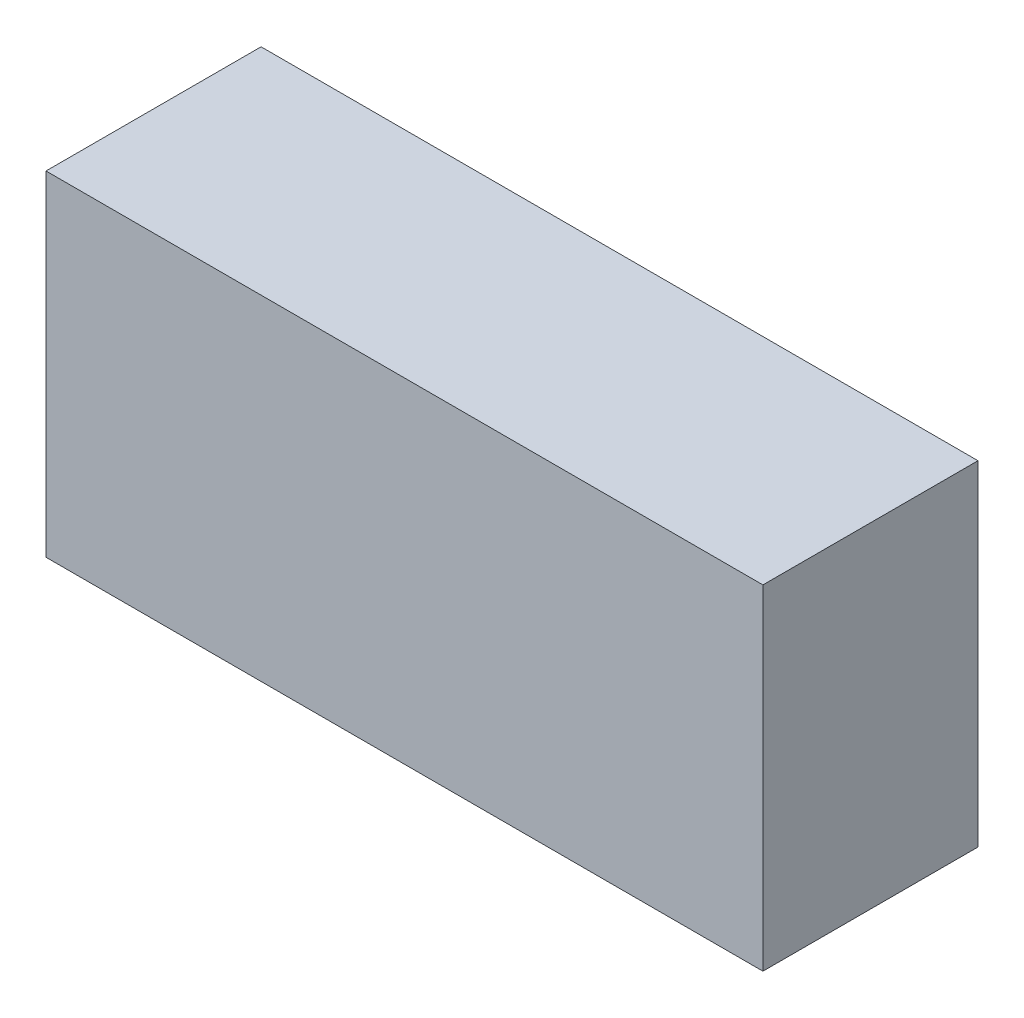
ISO-10303-21;
HEADER;
FILE_DESCRIPTION(('STEP AP214'),'2;1');
FILE_NAME('part.step','',(''),(''),'','','');
FILE_SCHEMA(('AUTOMOTIVE_DESIGN { 1 0 10303 214 1 1 1 1 }'));
ENDSEC;
DATA;
#1=APPLICATION_CONTEXT('core data for automotive mechanical design processes');
#2=APPLICATION_PROTOCOL_DEFINITION('international standard','automotive_design',2000,#1);
#3=PRODUCT_CONTEXT('',#1,'mechanical');
#4=PRODUCT('Part','Part','',(#3));
#5=PRODUCT_RELATED_PRODUCT_CATEGORY('part','',(#4));
#6=PRODUCT_DEFINITION_FORMATION('','',#4);
#7=PRODUCT_DEFINITION_CONTEXT('part definition',#1,'design');
#8=PRODUCT_DEFINITION('design','',#6,#7);
#9=PRODUCT_DEFINITION_SHAPE('','',#8);
#10=(LENGTH_UNIT() NAMED_UNIT(*) SI_UNIT(.MILLI.,.METRE.));
#11=(NAMED_UNIT(*) PLANE_ANGLE_UNIT() SI_UNIT($,.RADIAN.));
#12=(NAMED_UNIT(*) SI_UNIT($,.STERADIAN.) SOLID_ANGLE_UNIT());
#13=UNCERTAINTY_MEASURE_WITH_UNIT(LENGTH_MEASURE(1.E-05),#10,'distance_accuracy_value','');
#14=(GEOMETRIC_REPRESENTATION_CONTEXT(3) GLOBAL_UNCERTAINTY_ASSIGNED_CONTEXT((#13)) GLOBAL_UNIT_ASSIGNED_CONTEXT((#10,
#11,#12)) REPRESENTATION_CONTEXT('',''));
#15=CARTESIAN_POINT('',(0.,0.,0.));
#16=DIRECTION('',(0.,0.,1.));
#17=DIRECTION('',(1.,0.,0.));
#18=AXIS2_PLACEMENT_3D('',#15,#16,#17);
#19=CARTESIAN_POINT('',(0.,0.,45.));
#20=DIRECTION('',(1.,0.,0.));
#21=DIRECTION('',(0.,0.,-1.));
#22=AXIS2_PLACEMENT_3D('',#19,#20,#21);
#23=PLANE('',#22);
#24=DIRECTION('',(0.,-1.,0.));
#25=VECTOR('',#24,1.);
#26=CARTESIAN_POINT('',(0.,0.,0.));
#27=LINE('',#26,#25);
#28=CARTESIAN_POINT('',(0.,70.,0.));
#29=VERTEX_POINT('',#28);
#30=CARTESIAN_POINT('',(0.,0.,0.));
#31=VERTEX_POINT('',#30);
#32=EDGE_CURVE('E96',#29,#31,#27,.T.);
#33=ORIENTED_EDGE('',*,*,#32,.T.);
#34=DIRECTION('',(0.,0.,-1.));
#35=VECTOR('',#34,1.);
#36=CARTESIAN_POINT('',(0.,0.,45.));
#37=LINE('',#36,#35);
#38=CARTESIAN_POINT('',(0.,0.,45.));
#39=VERTEX_POINT('',#38);
#40=EDGE_CURVE('E11',#39,#31,#37,.T.);
#41=ORIENTED_EDGE('',*,*,#40,.F.);
#42=DIRECTION('',(0.,-1.,0.));
#43=VECTOR('',#42,1.);
#44=CARTESIAN_POINT('',(0.,0.,45.));
#45=LINE('',#44,#43);
#46=CARTESIAN_POINT('',(0.,70.,45.));
#47=VERTEX_POINT('',#46);
#48=EDGE_CURVE('E84',#47,#39,#45,.T.);
#49=ORIENTED_EDGE('',*,*,#48,.F.);
#50=DIRECTION('',(0.,0.,-1.));
#51=VECTOR('',#50,1.);
#52=CARTESIAN_POINT('',(0.,70.,45.));
#53=LINE('',#52,#51);
#54=EDGE_CURVE('E92',#47,#29,#53,.T.);
#55=ORIENTED_EDGE('',*,*,#54,.T.);
#56=EDGE_LOOP('',(#33,#41,#49,#55));
#57=FACE_BOUND('',#56,.T.);
#58=ADVANCED_FACE('F33',(#57),#23,.F.);
#59=CARTESIAN_POINT('',(0.,0.,45.));
#60=DIRECTION('',(0.,1.,0.));
#61=DIRECTION('',(0.,0.,1.));
#62=AXIS2_PLACEMENT_3D('',#59,#60,#61);
#63=PLANE('',#62);
#64=DIRECTION('',(1.,0.,0.));
#65=VECTOR('',#64,1.);
#66=CARTESIAN_POINT('',(0.,0.,0.));
#67=LINE('',#66,#65);
#68=CARTESIAN_POINT('',(150.,0.,0.));
#69=VERTEX_POINT('',#68);
#70=EDGE_CURVE('E88',#31,#69,#67,.T.);
#71=ORIENTED_EDGE('',*,*,#70,.T.);
#72=DIRECTION('',(0.,0.,-1.));
#73=VECTOR('',#72,1.);
#74=CARTESIAN_POINT('',(150.,0.,45.));
#75=LINE('',#74,#73);
#76=CARTESIAN_POINT('',(150.,0.,45.));
#77=VERTEX_POINT('',#76);
#78=EDGE_CURVE('E41',#77,#69,#75,.T.);
#79=ORIENTED_EDGE('',*,*,#78,.F.);
#80=DIRECTION('',(1.,0.,0.));
#81=VECTOR('',#80,1.);
#82=CARTESIAN_POINT('',(0.,0.,45.));
#83=LINE('',#82,#81);
#84=EDGE_CURVE('E79',#39,#77,#83,.T.);
#85=ORIENTED_EDGE('',*,*,#84,.F.);
#86=ORIENTED_EDGE('',*,*,#40,.T.);
#87=EDGE_LOOP('',(#71,#79,#85,#86));
#88=FACE_BOUND('',#87,.T.);
#89=ADVANCED_FACE('F87',(#88),#63,.F.);
#90=CARTESIAN_POINT('',(150.,0.,45.));
#91=DIRECTION('',(-1.,0.,0.));
#92=DIRECTION('',(0.,0.,1.));
#93=AXIS2_PLACEMENT_3D('',#90,#91,#92);
#94=PLANE('',#93);
#95=DIRECTION('',(0.,1.,0.));
#96=VECTOR('',#95,1.);
#97=CARTESIAN_POINT('',(150.,0.,0.));
#98=LINE('',#97,#96);
#99=CARTESIAN_POINT('',(150.,70.,0.));
#100=VERTEX_POINT('',#99);
#101=EDGE_CURVE('E66',#69,#100,#98,.T.);
#102=ORIENTED_EDGE('',*,*,#101,.T.);
#103=DIRECTION('',(0.,0.,-1.));
#104=VECTOR('',#103,1.);
#105=CARTESIAN_POINT('',(150.,70.,45.));
#106=LINE('',#105,#104);
#107=CARTESIAN_POINT('',(150.,70.,45.));
#108=VERTEX_POINT('',#107);
#109=EDGE_CURVE('E89',#108,#100,#106,.T.);
#110=ORIENTED_EDGE('',*,*,#109,.F.);
#111=DIRECTION('',(0.,1.,0.));
#112=VECTOR('',#111,1.);
#113=CARTESIAN_POINT('',(150.,0.,45.));
#114=LINE('',#113,#112);
#115=EDGE_CURVE('E82',#77,#108,#114,.T.);
#116=ORIENTED_EDGE('',*,*,#115,.F.);
#117=ORIENTED_EDGE('',*,*,#78,.T.);
#118=EDGE_LOOP('',(#102,#110,#116,#117));
#119=FACE_BOUND('',#118,.T.);
#120=ADVANCED_FACE('F90',(#119),#94,.F.);
#121=CARTESIAN_POINT('',(0.,70.,45.));
#122=DIRECTION('',(0.,-1.,0.));
#123=DIRECTION('',(0.,0.,-1.));
#124=AXIS2_PLACEMENT_3D('',#121,#122,#123);
#125=PLANE('',#124);
#126=DIRECTION('',(-1.,0.,0.));
#127=VECTOR('',#126,1.);
#128=CARTESIAN_POINT('',(0.,70.,0.));
#129=LINE('',#128,#127);
#130=EDGE_CURVE('E72',#100,#29,#129,.T.);
#131=ORIENTED_EDGE('',*,*,#130,.T.);
#132=ORIENTED_EDGE('',*,*,#54,.F.);
#133=DIRECTION('',(-1.,0.,0.));
#134=VECTOR('',#133,1.);
#135=CARTESIAN_POINT('',(0.,70.,45.));
#136=LINE('',#135,#134);
#137=EDGE_CURVE('E49',#108,#47,#136,.T.);
#138=ORIENTED_EDGE('',*,*,#137,.F.);
#139=ORIENTED_EDGE('',*,*,#109,.T.);
#140=EDGE_LOOP('',(#131,#132,#138,#139));
#141=FACE_BOUND('',#140,.T.);
#142=ADVANCED_FACE('F103',(#141),#125,.F.);
#143=CARTESIAN_POINT('',(0.,0.,45.));
#144=DIRECTION('',(0.,0.,-1.));
#145=DIRECTION('',(-1.,0.,0.));
#146=AXIS2_PLACEMENT_3D('',#143,#144,#145);
#147=PLANE('',#146);
#148=ORIENTED_EDGE('',*,*,#48,.T.);
#149=ORIENTED_EDGE('',*,*,#84,.T.);
#150=ORIENTED_EDGE('',*,*,#115,.T.);
#151=ORIENTED_EDGE('',*,*,#137,.T.);
#152=EDGE_LOOP('',(#148,#149,#150,#151));
#153=FACE_BOUND('',#152,.T.);
#154=ADVANCED_FACE('F80',(#153),#147,.F.);
#155=CARTESIAN_POINT('',(0.,0.,0.));
#156=DIRECTION('',(0.,0.,-1.));
#157=DIRECTION('',(-1.,0.,0.));
#158=AXIS2_PLACEMENT_3D('',#155,#156,#157);
#159=PLANE('',#158);
#160=ORIENTED_EDGE('',*,*,#32,.F.);
#161=ORIENTED_EDGE('',*,*,#130,.F.);
#162=ORIENTED_EDGE('',*,*,#101,.F.);
#163=ORIENTED_EDGE('',*,*,#70,.F.);
#164=EDGE_LOOP('',(#160,#161,#162,#163));
#165=FACE_BOUND('',#164,.T.);
#166=ADVANCED_FACE('F106',(#165),#159,.T.);
#167=CLOSED_SHELL('',(#58,#89,#120,#142,#154,#166));
#168=MANIFOLD_SOLID_BREP('B2',#167);
#169=ADVANCED_BREP_SHAPE_REPRESENTATION('',(#18,#168),#14);
#170=SHAPE_DEFINITION_REPRESENTATION(#9,#169);
ENDSEC;
END-ISO-10303-21;
